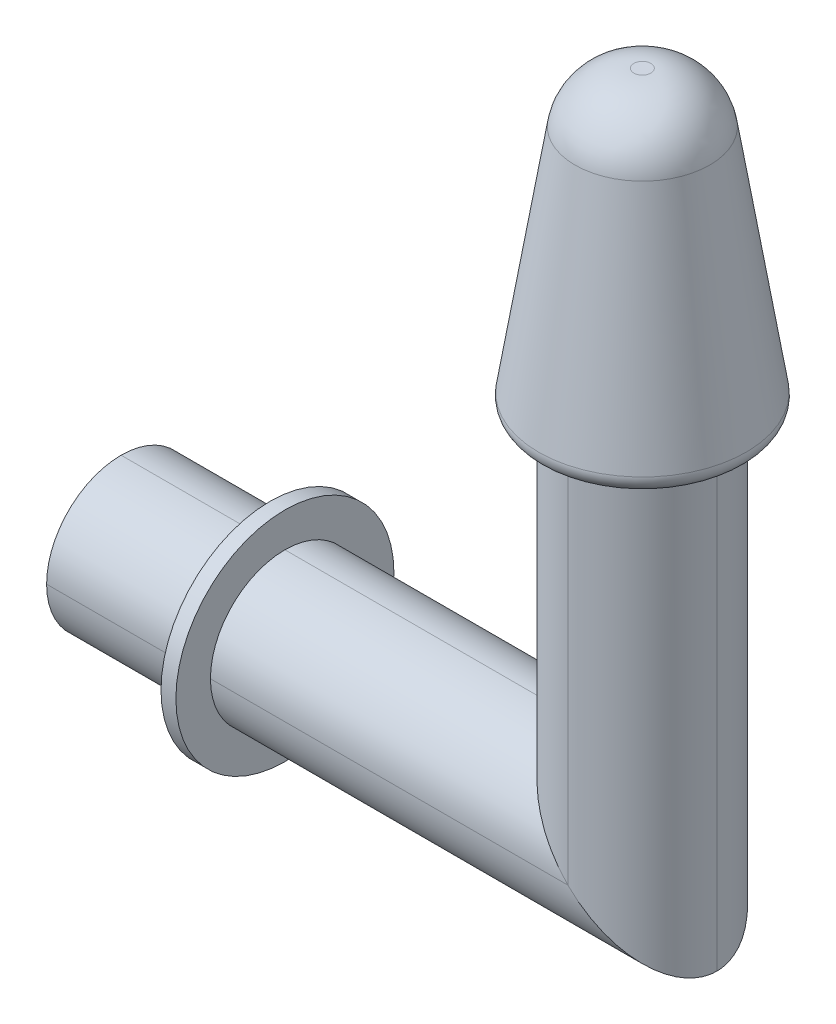
ISO-10303-21;
HEADER;
FILE_DESCRIPTION(('STEP AP214'),'2;1');
FILE_NAME('part.step','',(''),(''),'','','');
FILE_SCHEMA(('AUTOMOTIVE_DESIGN { 1 0 10303 214 1 1 1 1 }'));
ENDSEC;
DATA;
#1=APPLICATION_CONTEXT('core data for automotive mechanical design processes');
#2=APPLICATION_PROTOCOL_DEFINITION('international standard','automotive_design',2000,#1);
#3=PRODUCT_CONTEXT('',#1,'mechanical');
#4=PRODUCT('Part','Part','',(#3));
#5=PRODUCT_RELATED_PRODUCT_CATEGORY('part','',(#4));
#6=PRODUCT_DEFINITION_FORMATION('','',#4);
#7=PRODUCT_DEFINITION_CONTEXT('part definition',#1,'design');
#8=PRODUCT_DEFINITION('design','',#6,#7);
#9=PRODUCT_DEFINITION_SHAPE('','',#8);
#10=(LENGTH_UNIT() NAMED_UNIT(*) SI_UNIT(.MILLI.,.METRE.));
#11=(NAMED_UNIT(*) PLANE_ANGLE_UNIT() SI_UNIT($,.RADIAN.));
#12=(NAMED_UNIT(*) SI_UNIT($,.STERADIAN.) SOLID_ANGLE_UNIT());
#13=UNCERTAINTY_MEASURE_WITH_UNIT(LENGTH_MEASURE(1.E-05),#10,'distance_accuracy_value','');
#14=(GEOMETRIC_REPRESENTATION_CONTEXT(3) GLOBAL_UNCERTAINTY_ASSIGNED_CONTEXT((#13)) GLOBAL_UNIT_ASSIGNED_CONTEXT((#10,
#11,#12)) REPRESENTATION_CONTEXT('',''));
#15=CARTESIAN_POINT('',(0.,0.,0.));
#16=DIRECTION('',(0.,0.,1.));
#17=DIRECTION('',(1.,0.,0.));
#18=AXIS2_PLACEMENT_3D('',#15,#16,#17);
#19=CARTESIAN_POINT('',(-15.,-2.5,2.5));
#20=DIRECTION('',(-1.,0.,0.));
#21=DIRECTION('',(0.,0.,1.));
#22=AXIS2_PLACEMENT_3D('',#19,#20,#21);
#23=CYLINDRICAL_SURFACE('',#22,2.5);
#24=DIRECTION('',(1.,0.,0.));
#25=VECTOR('',#24,1.);
#26=CARTESIAN_POINT('',(5.,-5.,2.5));
#27=LINE('',#26,#25);
#28=CARTESIAN_POINT('',(-9.5,-5.,2.5));
#29=VERTEX_POINT('',#28);
#30=CARTESIAN_POINT('',(5.,-5.,2.5));
#31=VERTEX_POINT('',#30);
#32=EDGE_CURVE('E296',#29,#31,#27,.T.);
#33=ORIENTED_EDGE('',*,*,#32,.F.);
#34=CARTESIAN_POINT('',(-9.5,-2.5,2.5));
#35=DIRECTION('',(-1.,0.,0.));
#36=DIRECTION('',(0.,0.,1.));
#37=AXIS2_PLACEMENT_3D('',#34,#35,#36);
#38=CIRCLE('',#37,2.5);
#39=CARTESIAN_POINT('',(-9.5,-2.5,0.));
#40=VERTEX_POINT('',#39);
#41=EDGE_CURVE('E232',#29,#40,#38,.F.);
#42=ORIENTED_EDGE('',*,*,#41,.T.);
#43=DIRECTION('',(1.,0.,0.));
#44=VECTOR('',#43,1.);
#45=CARTESIAN_POINT('',(-15.,-2.5,0.));
#46=LINE('',#45,#44);
#47=CARTESIAN_POINT('',(2.5,-2.5,0.));
#48=VERTEX_POINT('',#47);
#49=EDGE_CURVE('E255',#48,#40,#46,.F.);
#50=ORIENTED_EDGE('',*,*,#49,.F.);
#51=CARTESIAN_POINT('',(2.5,-2.5,2.5));
#52=DIRECTION('',(-0.707106781186548,-0.707106781186547,0.));
#53=DIRECTION('',(-0.707106781186547,0.707106781186548,0.));
#54=AXIS2_PLACEMENT_3D('',#51,#52,#53);
#55=ELLIPSE('',#54,3.53553390593274,2.5);
#56=EDGE_CURVE('E299',#31,#48,#55,.F.);
#57=ORIENTED_EDGE('',*,*,#56,.F.);
#58=EDGE_LOOP('',(#33,#42,#50,#57));
#59=FACE_BOUND('',#58,.T.);
#60=ADVANCED_FACE('F36',(#59),#23,.T.);
#61=CARTESIAN_POINT('',(0.,-2.5,2.5));
#62=DIRECTION('',(1.,0.,0.));
#63=DIRECTION('',(0.,1.,0.));
#64=AXIS2_PLACEMENT_3D('',#61,#62,#63);
#65=CYLINDRICAL_SURFACE('',#64,2.5);
#66=ORIENTED_EDGE('',*,*,#49,.T.);
#67=CARTESIAN_POINT('',(-9.5,-2.5,2.5));
#68=DIRECTION('',(-1.,0.,0.));
#69=DIRECTION('',(0.,0.,1.));
#70=AXIS2_PLACEMENT_3D('',#67,#68,#69);
#71=CIRCLE('',#70,2.5);
#72=CARTESIAN_POINT('',(-9.5,0.,2.5));
#73=VERTEX_POINT('',#72);
#74=EDGE_CURVE('E493',#40,#73,#71,.F.);
#75=ORIENTED_EDGE('',*,*,#74,.T.);
#76=DIRECTION('',(-1.,0.,0.));
#77=VECTOR('',#76,1.);
#78=CARTESIAN_POINT('',(-15.,0.,2.5));
#79=LINE('',#78,#77);
#80=CARTESIAN_POINT('',(0.,0.,2.5));
#81=VERTEX_POINT('',#80);
#82=EDGE_CURVE('E279',#81,#73,#79,.T.);
#83=ORIENTED_EDGE('',*,*,#82,.F.);
#84=CARTESIAN_POINT('',(2.5,-2.5,2.5));
#85=DIRECTION('',(0.707106781186547,0.707106781186547,0.));
#86=DIRECTION('',(-0.707106781186547,0.707106781186547,0.));
#87=AXIS2_PLACEMENT_3D('',#84,#85,#86);
#88=ELLIPSE('',#87,3.53553390593274,2.5);
#89=EDGE_CURVE('E293',#48,#81,#88,.T.);
#90=ORIENTED_EDGE('',*,*,#89,.F.);
#91=EDGE_LOOP('',(#66,#75,#83,#90));
#92=FACE_BOUND('',#91,.T.);
#93=ADVANCED_FACE('F352',(#92),#65,.T.);
#94=CARTESIAN_POINT('',(0.,-2.5,2.5));
#95=DIRECTION('',(1.,0.,0.));
#96=DIRECTION('',(0.,0.,-1.));
#97=AXIS2_PLACEMENT_3D('',#94,#95,#96);
#98=CYLINDRICAL_SURFACE('',#97,2.5);
#99=DIRECTION('',(1.,0.,0.));
#100=VECTOR('',#99,1.);
#101=CARTESIAN_POINT('',(0.,-2.5,5.));
#102=LINE('',#101,#100);
#103=CARTESIAN_POINT('',(-9.5,-2.5,5.));
#104=VERTEX_POINT('',#103);
#105=CARTESIAN_POINT('',(2.5,-2.5,5.));
#106=VERTEX_POINT('',#105);
#107=EDGE_CURVE('E254',#104,#106,#102,.T.);
#108=ORIENTED_EDGE('',*,*,#107,.F.);
#109=CARTESIAN_POINT('',(-9.5,-2.5,2.5));
#110=DIRECTION('',(-1.,0.,0.));
#111=DIRECTION('',(0.,0.,1.));
#112=AXIS2_PLACEMENT_3D('',#109,#110,#111);
#113=CIRCLE('',#112,2.5);
#114=EDGE_CURVE('E491',#104,#29,#113,.F.);
#115=ORIENTED_EDGE('',*,*,#114,.T.);
#116=ORIENTED_EDGE('',*,*,#32,.T.);
#117=CARTESIAN_POINT('',(2.5,-2.5,2.5));
#118=DIRECTION('',(0.707106781186548,0.707106781186547,0.));
#119=DIRECTION('',(-0.707106781186547,0.707106781186548,0.));
#120=AXIS2_PLACEMENT_3D('',#117,#118,#119);
#121=ELLIPSE('',#120,3.53553390593274,2.5);
#122=EDGE_CURVE('E284',#106,#31,#121,.T.);
#123=ORIENTED_EDGE('',*,*,#122,.F.);
#124=EDGE_LOOP('',(#108,#115,#116,#123));
#125=FACE_BOUND('',#124,.T.);
#126=ADVANCED_FACE('F359',(#125),#98,.T.);
#127=CARTESIAN_POINT('',(0.,-2.5,2.5));
#128=DIRECTION('',(-1.,0.,0.));
#129=DIRECTION('',(0.,-1.,0.));
#130=AXIS2_PLACEMENT_3D('',#127,#128,#129);
#131=CYLINDRICAL_SURFACE('',#130,2.5);
#132=ORIENTED_EDGE('',*,*,#82,.T.);
#133=CARTESIAN_POINT('',(-9.5,-2.5,2.5));
#134=DIRECTION('',(-1.,0.,0.));
#135=DIRECTION('',(0.,0.,1.));
#136=AXIS2_PLACEMENT_3D('',#133,#134,#135);
#137=CIRCLE('',#136,2.5);
#138=EDGE_CURVE('E488',#73,#104,#137,.F.);
#139=ORIENTED_EDGE('',*,*,#138,.T.);
#140=ORIENTED_EDGE('',*,*,#107,.T.);
#141=CARTESIAN_POINT('',(2.5,-2.5,2.5));
#142=DIRECTION('',(-0.707106781186547,-0.707106781186547,0.));
#143=DIRECTION('',(-0.707106781186547,0.707106781186547,0.));
#144=AXIS2_PLACEMENT_3D('',#141,#142,#143);
#145=ELLIPSE('',#144,3.53553390593274,2.5);
#146=EDGE_CURVE('E307',#81,#106,#145,.F.);
#147=ORIENTED_EDGE('',*,*,#146,.F.);
#148=EDGE_LOOP('',(#132,#139,#140,#147));
#149=FACE_BOUND('',#148,.T.);
#150=ADVANCED_FACE('F384',(#149),#131,.T.);
#151=CARTESIAN_POINT('',(2.5,-5.,2.5));
#152=DIRECTION('',(0.,-1.,0.));
#153=DIRECTION('',(1.,0.,0.));
#154=AXIS2_PLACEMENT_3D('',#151,#152,#153);
#155=CYLINDRICAL_SURFACE('',#154,2.5);
#156=DIRECTION('',(0.,1.,0.));
#157=VECTOR('',#156,1.);
#158=CARTESIAN_POINT('',(5.,10.,2.5));
#159=LINE('',#158,#157);
#160=CARTESIAN_POINT('',(5.,10.,2.5));
#161=VERTEX_POINT('',#160);
#162=EDGE_CURVE('E287',#31,#161,#159,.T.);
#163=ORIENTED_EDGE('',*,*,#162,.F.);
#164=ORIENTED_EDGE('',*,*,#56,.T.);
#165=DIRECTION('',(0.,1.,0.));
#166=VECTOR('',#165,1.);
#167=CARTESIAN_POINT('',(2.5,-5.,0.));
#168=LINE('',#167,#166);
#169=CARTESIAN_POINT('',(2.5,10.,0.));
#170=VERTEX_POINT('',#169);
#171=EDGE_CURVE('E290',#170,#48,#168,.F.);
#172=ORIENTED_EDGE('',*,*,#171,.F.);
#173=CARTESIAN_POINT('',(2.5,10.,2.5));
#174=DIRECTION('',(0.,-1.,0.));
#175=DIRECTION('',(0.,0.,-1.));
#176=AXIS2_PLACEMENT_3D('',#173,#174,#175);
#177=CIRCLE('',#176,2.5);
#178=EDGE_CURVE('E261',#161,#170,#177,.F.);
#179=ORIENTED_EDGE('',*,*,#178,.F.);
#180=EDGE_LOOP('',(#163,#164,#172,#179));
#181=FACE_BOUND('',#180,.T.);
#182=ADVANCED_FACE('F381',(#181),#155,.T.);
#183=CARTESIAN_POINT('',(2.5,10.,2.5));
#184=DIRECTION('',(0.,1.,0.));
#185=DIRECTION('',(-1.,0.,0.));
#186=AXIS2_PLACEMENT_3D('',#183,#184,#185);
#187=CYLINDRICAL_SURFACE('',#186,2.5);
#188=ORIENTED_EDGE('',*,*,#171,.T.);
#189=ORIENTED_EDGE('',*,*,#89,.T.);
#190=DIRECTION('',(0.,-1.,0.));
#191=VECTOR('',#190,1.);
#192=CARTESIAN_POINT('',(0.,0.,2.5));
#193=LINE('',#192,#191);
#194=CARTESIAN_POINT('',(0.,10.,2.5));
#195=VERTEX_POINT('',#194);
#196=EDGE_CURVE('E236',#195,#81,#193,.T.);
#197=ORIENTED_EDGE('',*,*,#196,.F.);
#198=CARTESIAN_POINT('',(2.5,10.,2.5));
#199=DIRECTION('',(0.,-1.,0.));
#200=DIRECTION('',(0.,0.,-1.));
#201=AXIS2_PLACEMENT_3D('',#198,#199,#200);
#202=CIRCLE('',#201,2.5);
#203=EDGE_CURVE('E258',#170,#195,#202,.F.);
#204=ORIENTED_EDGE('',*,*,#203,.F.);
#205=EDGE_LOOP('',(#188,#189,#197,#204));
#206=FACE_BOUND('',#205,.T.);
#207=ADVANCED_FACE('F383',(#206),#187,.T.);
#208=CARTESIAN_POINT('',(2.5,0.,2.5));
#209=DIRECTION('',(0.,1.,0.));
#210=DIRECTION('',(-1.,0.,0.));
#211=AXIS2_PLACEMENT_3D('',#208,#209,#210);
#212=CYLINDRICAL_SURFACE('',#211,2.5);
#213=ORIENTED_EDGE('',*,*,#162,.T.);
#214=CARTESIAN_POINT('',(2.5,10.,2.5));
#215=DIRECTION('',(0.,-1.,0.));
#216=DIRECTION('',(0.,0.,-1.));
#217=AXIS2_PLACEMENT_3D('',#214,#215,#216);
#218=CIRCLE('',#217,2.5);
#219=CARTESIAN_POINT('',(2.5,10.,5.));
#220=VERTEX_POINT('',#219);
#221=EDGE_CURVE('E264',#220,#161,#218,.F.);
#222=ORIENTED_EDGE('',*,*,#221,.F.);
#223=DIRECTION('',(0.,1.,0.));
#224=VECTOR('',#223,1.);
#225=CARTESIAN_POINT('',(2.5,0.,5.));
#226=LINE('',#225,#224);
#227=EDGE_CURVE('E252',#106,#220,#226,.T.);
#228=ORIENTED_EDGE('',*,*,#227,.F.);
#229=ORIENTED_EDGE('',*,*,#122,.T.);
#230=EDGE_LOOP('',(#213,#222,#228,#229));
#231=FACE_BOUND('',#230,.T.);
#232=ADVANCED_FACE('F389',(#231),#212,.T.);
#233=CARTESIAN_POINT('',(2.5,0.,2.5));
#234=DIRECTION('',(0.,-1.,0.));
#235=DIRECTION('',(1.,0.,0.));
#236=AXIS2_PLACEMENT_3D('',#233,#234,#235);
#237=CYLINDRICAL_SURFACE('',#236,2.5);
#238=CARTESIAN_POINT('',(2.5,10.,2.5));
#239=DIRECTION('',(0.,-1.,0.));
#240=DIRECTION('',(0.,0.,-1.));
#241=AXIS2_PLACEMENT_3D('',#238,#239,#240);
#242=CIRCLE('',#241,2.5);
#243=EDGE_CURVE('E267',#195,#220,#242,.F.);
#244=ORIENTED_EDGE('',*,*,#243,.F.);
#245=ORIENTED_EDGE('',*,*,#196,.T.);
#246=ORIENTED_EDGE('',*,*,#146,.T.);
#247=ORIENTED_EDGE('',*,*,#227,.T.);
#248=EDGE_LOOP('',(#244,#245,#246,#247));
#249=FACE_BOUND('',#248,.T.);
#250=ADVANCED_FACE('F347',(#249),#237,.T.);
#251=CARTESIAN_POINT('',(2.5,10.,2.5));
#252=DIRECTION('',(0.,1.,0.));
#253=DIRECTION('',(0.,0.,1.));
#254=AXIS2_PLACEMENT_3D('',#251,#252,#253);
#255=PLANE('',#254);
#256=CARTESIAN_POINT('',(2.5,10.,2.5));
#257=DIRECTION('',(0.,1.,0.));
#258=DIRECTION('',(0.,0.,1.));
#259=AXIS2_PLACEMENT_3D('',#256,#257,#258);
#260=CIRCLE('',#259,2.99033715568735);
#261=CARTESIAN_POINT('',(2.5,10.,5.49033715568735));
#262=VERTEX_POINT('',#261);
#263=EDGE_CURVE('E185',#262,#262,#260,.F.);
#264=ORIENTED_EDGE('',*,*,#263,.T.);
#265=EDGE_LOOP('',(#264));
#266=FACE_BOUND('',#265,.T.);
#267=ORIENTED_EDGE('',*,*,#178,.T.);
#268=ORIENTED_EDGE('',*,*,#203,.T.);
#269=ORIENTED_EDGE('',*,*,#243,.T.);
#270=ORIENTED_EDGE('',*,*,#221,.T.);
#271=EDGE_LOOP('',(#267,#268,#269,#270));
#272=FACE_BOUND('',#271,.T.);
#273=ADVANCED_FACE('F322',(#266,#272),#255,.F.);
#274=CARTESIAN_POINT('',(2.5,20.,2.5));
#275=DIRECTION('',(0.,1.,0.));
#276=DIRECTION('',(0.,0.,1.));
#277=AXIS2_PLACEMENT_3D('',#274,#275,#276);
#278=PLANE('',#277);
#279=CARTESIAN_POINT('',(2.5,20.,2.5));
#280=DIRECTION('',(0.,1.,0.));
#281=DIRECTION('',(0.,0.,1.));
#282=AXIS2_PLACEMENT_3D('',#279,#280,#281);
#283=CIRCLE('',#282,0.283756164571326);
#284=CARTESIAN_POINT('',(2.5,20.,2.78375616457133));
#285=VERTEX_POINT('',#284);
#286=EDGE_CURVE('E310',#285,#285,#283,.T.);
#287=ORIENTED_EDGE('',*,*,#286,.T.);
#288=EDGE_LOOP('',(#287));
#289=FACE_BOUND('',#288,.T.);
#290=ADVANCED_FACE('F334',(#289),#278,.T.);
#291=CARTESIAN_POINT('',(2.5,10.,2.5));
#292=DIRECTION('',(0.,-1.,0.));
#293=DIRECTION('',(0.,0.,1.));
#294=AXIS2_PLACEMENT_3D('',#291,#292,#293);
#295=CONICAL_SURFACE('',#294,3.57576193874362,0.15707963267949);
#296=CARTESIAN_POINT('',(2.5,10.5782172325201,2.5));
#297=DIRECTION('',(0.,1.,0.));
#298=DIRECTION('',(0.,0.,1.));
#299=AXIS2_PLACEMENT_3D('',#296,#297,#298);
#300=CIRCLE('',#299,3.48418132598492);
#301=CARTESIAN_POINT('',(2.5,10.5782172325201,5.98418132598492));
#302=VERTEX_POINT('',#301);
#303=EDGE_CURVE('E316',#302,#302,#300,.T.);
#304=ORIENTED_EDGE('',*,*,#303,.T.);
#305=EDGE_LOOP('',(#304));
#306=FACE_BOUND('',#305,.T.);
#307=CARTESIAN_POINT('',(2.5,18.3128689300805,2.5));
#308=DIRECTION('',(0.,-1.,0.));
#309=DIRECTION('',(0.,0.,-1.));
#310=AXIS2_PLACEMENT_3D('',#307,#308,#309);
#311=CIRCLE('',#310,2.2591328457616);
#312=CARTESIAN_POINT('',(2.5,18.3128689300805,0.240867154238399));
#313=VERTEX_POINT('',#312);
#314=EDGE_CURVE('E313',#313,#313,#311,.T.);
#315=ORIENTED_EDGE('',*,*,#314,.T.);
#316=EDGE_LOOP('',(#315));
#317=FACE_BOUND('',#316,.T.);
#318=ADVANCED_FACE('F331',(#306,#317),#295,.T.);
#319=CARTESIAN_POINT('',(2.5,18.,2.5));
#320=DIRECTION('',(0.,1.,0.));
#321=DIRECTION('',(0.,0.,1.));
#322=AXIS2_PLACEMENT_3D('',#319,#320,#321);
#323=DEGENERATE_TOROIDAL_SURFACE('',#322,0.283756164571326,2.,.T.);
#324=ORIENTED_EDGE('',*,*,#314,.F.);
#325=EDGE_LOOP('',(#324));
#326=FACE_BOUND('',#325,.T.);
#327=ORIENTED_EDGE('',*,*,#286,.F.);
#328=EDGE_LOOP('',(#327));
#329=FACE_BOUND('',#328,.T.);
#330=ADVANCED_FACE('F328',(#326,#329),#323,.T.);
#331=CARTESIAN_POINT('',(2.5,10.5,2.5));
#332=DIRECTION('',(0.,1.,0.));
#333=DIRECTION('',(0.,0.,1.));
#334=AXIS2_PLACEMENT_3D('',#331,#332,#333);
#335=TOROIDAL_SURFACE('',#334,2.99033715568735,0.5);
#336=ORIENTED_EDGE('',*,*,#263,.F.);
#337=EDGE_LOOP('',(#336));
#338=FACE_BOUND('',#337,.T.);
#339=ORIENTED_EDGE('',*,*,#303,.F.);
#340=EDGE_LOOP('',(#339));
#341=FACE_BOUND('',#340,.T.);
#342=ADVANCED_FACE('F38',(#338,#341),#335,.T.);
#343=CARTESIAN_POINT('',(-9.5,-2.5,2.5));
#344=DIRECTION('',(-1.,0.,0.));
#345=DIRECTION('',(0.,0.,1.));
#346=AXIS2_PLACEMENT_3D('',#343,#344,#345);
#347=CYLINDRICAL_SURFACE('',#346,3.66000857921071);
#348=CARTESIAN_POINT('',(-9.5,-2.5,2.5));
#349=DIRECTION('',(-1.,0.,0.));
#350=DIRECTION('',(0.,0.,1.));
#351=AXIS2_PLACEMENT_3D('',#348,#349,#350);
#352=CIRCLE('',#351,3.66000857921071);
#353=CARTESIAN_POINT('',(-9.5,-2.5,6.16000857921071));
#354=VERTEX_POINT('',#353);
#355=EDGE_CURVE('E464',#354,#354,#352,.T.);
#356=ORIENTED_EDGE('',*,*,#355,.T.);
#357=EDGE_LOOP('',(#356));
#358=FACE_BOUND('',#357,.T.);
#359=CARTESIAN_POINT('',(-10.,-2.5,2.5));
#360=DIRECTION('',(-1.,0.,0.));
#361=DIRECTION('',(0.,0.,1.));
#362=AXIS2_PLACEMENT_3D('',#359,#360,#361);
#363=CIRCLE('',#362,3.66000857921071);
#364=CARTESIAN_POINT('',(-10.,-2.5,6.16000857921071));
#365=VERTEX_POINT('',#364);
#366=EDGE_CURVE('E465',#365,#365,#363,.T.);
#367=ORIENTED_EDGE('',*,*,#366,.F.);
#368=EDGE_LOOP('',(#367));
#369=FACE_BOUND('',#368,.T.);
#370=ADVANCED_FACE('F327',(#358,#369),#347,.T.);
#371=CARTESIAN_POINT('',(-9.5,-2.5,2.5));
#372=DIRECTION('',(-1.,0.,0.));
#373=DIRECTION('',(0.,0.,1.));
#374=AXIS2_PLACEMENT_3D('',#371,#372,#373);
#375=PLANE('',#374);
#376=ORIENTED_EDGE('',*,*,#41,.F.);
#377=ORIENTED_EDGE('',*,*,#114,.F.);
#378=ORIENTED_EDGE('',*,*,#138,.F.);
#379=ORIENTED_EDGE('',*,*,#74,.F.);
#380=EDGE_LOOP('',(#376,#377,#378,#379));
#381=FACE_BOUND('',#380,.T.);
#382=ORIENTED_EDGE('',*,*,#355,.F.);
#383=EDGE_LOOP('',(#382));
#384=FACE_BOUND('',#383,.T.);
#385=ADVANCED_FACE('F445',(#381,#384),#375,.F.);
#386=CARTESIAN_POINT('',(-10.,-2.5,2.5));
#387=DIRECTION('',(-1.,0.,0.));
#388=DIRECTION('',(0.,0.,1.));
#389=AXIS2_PLACEMENT_3D('',#386,#387,#388);
#390=PLANE('',#389);
#391=CARTESIAN_POINT('',(-10.,-2.5,2.5));
#392=DIRECTION('',(-1.,0.,0.));
#393=DIRECTION('',(0.,0.,1.));
#394=AXIS2_PLACEMENT_3D('',#391,#392,#393);
#395=CIRCLE('',#394,2.5);
#396=CARTESIAN_POINT('',(-10.,-2.5,5.));
#397=VERTEX_POINT('',#396);
#398=CARTESIAN_POINT('',(-10.,-5.,2.5));
#399=VERTEX_POINT('',#398);
#400=EDGE_CURVE('E475',#397,#399,#395,.F.);
#401=ORIENTED_EDGE('',*,*,#400,.T.);
#402=CARTESIAN_POINT('',(-10.,-2.5,2.5));
#403=DIRECTION('',(-1.,0.,0.));
#404=DIRECTION('',(0.,0.,1.));
#405=AXIS2_PLACEMENT_3D('',#402,#403,#404);
#406=CIRCLE('',#405,2.5);
#407=CARTESIAN_POINT('',(-10.,-2.5,0.));
#408=VERTEX_POINT('',#407);
#409=EDGE_CURVE('E59',#399,#408,#406,.F.);
#410=ORIENTED_EDGE('',*,*,#409,.T.);
#411=CARTESIAN_POINT('',(-10.,-2.5,2.5));
#412=DIRECTION('',(-1.,0.,0.));
#413=DIRECTION('',(0.,0.,1.));
#414=AXIS2_PLACEMENT_3D('',#411,#412,#413);
#415=CIRCLE('',#414,2.5);
#416=CARTESIAN_POINT('',(-10.,0.,2.5));
#417=VERTEX_POINT('',#416);
#418=EDGE_CURVE('E52',#408,#417,#415,.F.);
#419=ORIENTED_EDGE('',*,*,#418,.T.);
#420=CARTESIAN_POINT('',(-10.,-2.5,2.5));
#421=DIRECTION('',(-1.,0.,0.));
#422=DIRECTION('',(0.,0.,1.));
#423=AXIS2_PLACEMENT_3D('',#420,#421,#422);
#424=CIRCLE('',#423,2.5);
#425=EDGE_CURVE('E472',#417,#397,#424,.F.);
#426=ORIENTED_EDGE('',*,*,#425,.T.);
#427=EDGE_LOOP('',(#401,#410,#419,#426));
#428=FACE_BOUND('',#427,.T.);
#429=ORIENTED_EDGE('',*,*,#366,.T.);
#430=EDGE_LOOP('',(#429));
#431=FACE_BOUND('',#430,.T.);
#432=ADVANCED_FACE('F433',(#428,#431),#390,.T.);
#433=ORIENTED_EDGE('',*,*,#425,.F.);
#434=CARTESIAN_POINT('',(-15.,0.,2.5));
#435=VERTEX_POINT('',#434);
#436=EDGE_CURVE('E278',#417,#435,#79,.T.);
#437=ORIENTED_EDGE('',*,*,#436,.T.);
#438=CARTESIAN_POINT('',(-15.,-2.5,2.5));
#439=DIRECTION('',(1.,0.,0.));
#440=DIRECTION('',(0.,0.,-1.));
#441=AXIS2_PLACEMENT_3D('',#438,#439,#440);
#442=CIRCLE('',#441,2.5);
#443=CARTESIAN_POINT('',(-15.,-2.5,5.));
#444=VERTEX_POINT('',#443);
#445=EDGE_CURVE('E282',#444,#435,#442,.F.);
#446=ORIENTED_EDGE('',*,*,#445,.F.);
#447=EDGE_CURVE('E256',#444,#397,#102,.T.);
#448=ORIENTED_EDGE('',*,*,#447,.T.);
#449=EDGE_LOOP('',(#433,#437,#446,#448));
#450=FACE_BOUND('',#449,.T.);
#451=ADVANCED_FACE('F377',(#450),#131,.T.);
#452=ORIENTED_EDGE('',*,*,#400,.F.);
#453=ORIENTED_EDGE('',*,*,#447,.F.);
#454=CARTESIAN_POINT('',(-15.,-2.5,2.5));
#455=DIRECTION('',(1.,0.,0.));
#456=DIRECTION('',(0.,0.,-1.));
#457=AXIS2_PLACEMENT_3D('',#454,#455,#456);
#458=CIRCLE('',#457,2.5);
#459=CARTESIAN_POINT('',(-15.,-5.,2.5));
#460=VERTEX_POINT('',#459);
#461=EDGE_CURVE('E275',#460,#444,#458,.F.);
#462=ORIENTED_EDGE('',*,*,#461,.F.);
#463=EDGE_CURVE('E297',#460,#399,#27,.T.);
#464=ORIENTED_EDGE('',*,*,#463,.T.);
#465=EDGE_LOOP('',(#452,#453,#462,#464));
#466=FACE_BOUND('',#465,.T.);
#467=ADVANCED_FACE('F373',(#466),#98,.T.);
#468=ORIENTED_EDGE('',*,*,#418,.F.);
#469=CARTESIAN_POINT('',(-15.,-2.5,0.));
#470=VERTEX_POINT('',#469);
#471=EDGE_CURVE('E302',#408,#470,#46,.F.);
#472=ORIENTED_EDGE('',*,*,#471,.T.);
#473=CARTESIAN_POINT('',(-15.,-2.5,2.5));
#474=DIRECTION('',(1.,0.,0.));
#475=DIRECTION('',(0.,0.,-1.));
#476=AXIS2_PLACEMENT_3D('',#473,#474,#475);
#477=CIRCLE('',#476,2.5);
#478=EDGE_CURVE('E272',#435,#470,#477,.F.);
#479=ORIENTED_EDGE('',*,*,#478,.F.);
#480=ORIENTED_EDGE('',*,*,#436,.F.);
#481=EDGE_LOOP('',(#468,#472,#479,#480));
#482=FACE_BOUND('',#481,.T.);
#483=ADVANCED_FACE('F362',(#482),#65,.T.);
#484=ORIENTED_EDGE('',*,*,#409,.F.);
#485=ORIENTED_EDGE('',*,*,#463,.F.);
#486=CARTESIAN_POINT('',(-15.,-2.5,2.5));
#487=DIRECTION('',(1.,0.,0.));
#488=DIRECTION('',(0.,0.,-1.));
#489=AXIS2_PLACEMENT_3D('',#486,#487,#488);
#490=CIRCLE('',#489,2.5);
#491=EDGE_CURVE('E270',#470,#460,#490,.F.);
#492=ORIENTED_EDGE('',*,*,#491,.F.);
#493=ORIENTED_EDGE('',*,*,#471,.F.);
#494=EDGE_LOOP('',(#484,#485,#492,#493));
#495=FACE_BOUND('',#494,.T.);
#496=ADVANCED_FACE('F355',(#495),#23,.T.);
#497=CARTESIAN_POINT('',(-15.,0.,5.));
#498=DIRECTION('',(1.,0.,0.));
#499=DIRECTION('',(0.,0.,-1.));
#500=AXIS2_PLACEMENT_3D('',#497,#498,#499);
#501=PLANE('',#500);
#502=CARTESIAN_POINT('',(-15.,-2.5,2.5));
#503=DIRECTION('',(1.,0.,0.));
#504=DIRECTION('',(0.,0.,-1.));
#505=AXIS2_PLACEMENT_3D('',#502,#503,#504);
#506=CIRCLE('',#505,2.3);
#507=CARTESIAN_POINT('',(-15.,-4.8,2.5));
#508=VERTEX_POINT('',#507);
#509=CARTESIAN_POINT('',(-15.,-2.5,4.8));
#510=VERTEX_POINT('',#509);
#511=EDGE_CURVE('E200',#508,#510,#506,.F.);
#512=ORIENTED_EDGE('',*,*,#511,.F.);
#513=CARTESIAN_POINT('',(-15.,-2.5,2.5));
#514=DIRECTION('',(1.,0.,0.));
#515=DIRECTION('',(0.,0.,-1.));
#516=AXIS2_PLACEMENT_3D('',#513,#514,#515);
#517=CIRCLE('',#516,2.3);
#518=CARTESIAN_POINT('',(-15.,-2.5,0.2));
#519=VERTEX_POINT('',#518);
#520=EDGE_CURVE('E237',#519,#508,#517,.F.);
#521=ORIENTED_EDGE('',*,*,#520,.F.);
#522=CARTESIAN_POINT('',(-15.,-2.5,2.5));
#523=DIRECTION('',(1.,0.,0.));
#524=DIRECTION('',(0.,0.,-1.));
#525=AXIS2_PLACEMENT_3D('',#522,#523,#524);
#526=CIRCLE('',#525,2.3);
#527=CARTESIAN_POINT('',(-15.,-0.200000000000002,2.5));
#528=VERTEX_POINT('',#527);
#529=EDGE_CURVE('E203',#528,#519,#526,.F.);
#530=ORIENTED_EDGE('',*,*,#529,.F.);
#531=CARTESIAN_POINT('',(-15.,-2.5,2.5));
#532=DIRECTION('',(1.,0.,0.));
#533=DIRECTION('',(0.,0.,-1.));
#534=AXIS2_PLACEMENT_3D('',#531,#532,#533);
#535=CIRCLE('',#534,2.3);
#536=EDGE_CURVE('E197',#510,#528,#535,.F.);
#537=ORIENTED_EDGE('',*,*,#536,.F.);
#538=EDGE_LOOP('',(#512,#521,#530,#537));
#539=FACE_BOUND('',#538,.T.);
#540=ORIENTED_EDGE('',*,*,#461,.T.);
#541=ORIENTED_EDGE('',*,*,#445,.T.);
#542=ORIENTED_EDGE('',*,*,#478,.T.);
#543=ORIENTED_EDGE('',*,*,#491,.T.);
#544=EDGE_LOOP('',(#540,#541,#542,#543));
#545=FACE_BOUND('',#544,.T.);
#546=ADVANCED_FACE('F366',(#539,#545),#501,.F.);
#547=CARTESIAN_POINT('',(0.,-2.5,2.5));
#548=DIRECTION('',(-1.,0.,0.));
#549=DIRECTION('',(0.,-1.,0.));
#550=AXIS2_PLACEMENT_3D('',#547,#548,#549);
#551=CYLINDRICAL_SURFACE('',#550,2.3);
#552=DIRECTION('',(-1.,0.,0.));
#553=VECTOR('',#552,1.);
#554=CARTESIAN_POINT('',(0.,-0.2,2.5));
#555=LINE('',#554,#553);
#556=CARTESIAN_POINT('',(-10.,-0.200000000000001,2.5));
#557=VERTEX_POINT('',#556);
#558=EDGE_CURVE('E190',#557,#528,#555,.T.);
#559=ORIENTED_EDGE('',*,*,#558,.F.);
#560=CARTESIAN_POINT('',(-10.,-2.5,2.5));
#561=DIRECTION('',(-1.,0.,0.));
#562=DIRECTION('',(0.,0.,1.));
#563=AXIS2_PLACEMENT_3D('',#560,#561,#562);
#564=CIRCLE('',#563,2.3);
#565=CARTESIAN_POINT('',(-10.,-2.5,4.8));
#566=VERTEX_POINT('',#565);
#567=EDGE_CURVE('E45',#557,#566,#564,.F.);
#568=ORIENTED_EDGE('',*,*,#567,.T.);
#569=DIRECTION('',(-1.,0.,0.));
#570=VECTOR('',#569,1.);
#571=CARTESIAN_POINT('',(0.,-2.5,4.8));
#572=LINE('',#571,#570);
#573=EDGE_CURVE('E223',#510,#566,#572,.F.);
#574=ORIENTED_EDGE('',*,*,#573,.F.);
#575=ORIENTED_EDGE('',*,*,#536,.T.);
#576=EDGE_LOOP('',(#559,#568,#574,#575));
#577=FACE_BOUND('',#576,.T.);
#578=ADVANCED_FACE('F195',(#577),#551,.F.);
#579=CARTESIAN_POINT('',(0.,-2.5,2.5));
#580=DIRECTION('',(1.,0.,0.));
#581=DIRECTION('',(0.,0.,-1.));
#582=AXIS2_PLACEMENT_3D('',#579,#580,#581);
#583=CYLINDRICAL_SURFACE('',#582,2.3);
#584=ORIENTED_EDGE('',*,*,#573,.T.);
#585=CARTESIAN_POINT('',(-10.,-2.5,2.5));
#586=DIRECTION('',(-1.,0.,0.));
#587=DIRECTION('',(0.,0.,1.));
#588=AXIS2_PLACEMENT_3D('',#585,#586,#587);
#589=CIRCLE('',#588,2.3);
#590=CARTESIAN_POINT('',(-10.,-4.8,2.5));
#591=VERTEX_POINT('',#590);
#592=EDGE_CURVE('E180',#566,#591,#589,.F.);
#593=ORIENTED_EDGE('',*,*,#592,.T.);
#594=DIRECTION('',(1.,0.,0.));
#595=VECTOR('',#594,1.);
#596=CARTESIAN_POINT('',(0.,-4.8,2.5));
#597=LINE('',#596,#595);
#598=EDGE_CURVE('E497',#508,#591,#597,.T.);
#599=ORIENTED_EDGE('',*,*,#598,.F.);
#600=ORIENTED_EDGE('',*,*,#511,.T.);
#601=EDGE_LOOP('',(#584,#593,#599,#600));
#602=FACE_BOUND('',#601,.T.);
#603=ADVANCED_FACE('F399',(#602),#583,.F.);
#604=CARTESIAN_POINT('',(0.,-2.5,2.5));
#605=DIRECTION('',(1.,0.,0.));
#606=DIRECTION('',(0.,1.,0.));
#607=AXIS2_PLACEMENT_3D('',#604,#605,#606);
#608=CYLINDRICAL_SURFACE('',#607,2.3);
#609=DIRECTION('',(1.,0.,0.));
#610=VECTOR('',#609,1.);
#611=CARTESIAN_POINT('',(0.,-2.5,0.2));
#612=LINE('',#611,#610);
#613=CARTESIAN_POINT('',(-10.,-2.5,0.2));
#614=VERTEX_POINT('',#613);
#615=EDGE_CURVE('E192',#614,#519,#612,.F.);
#616=ORIENTED_EDGE('',*,*,#615,.F.);
#617=CARTESIAN_POINT('',(-10.,-2.5,2.5));
#618=DIRECTION('',(-1.,0.,0.));
#619=DIRECTION('',(0.,0.,1.));
#620=AXIS2_PLACEMENT_3D('',#617,#618,#619);
#621=CIRCLE('',#620,2.3);
#622=EDGE_CURVE('E177',#614,#557,#621,.F.);
#623=ORIENTED_EDGE('',*,*,#622,.T.);
#624=ORIENTED_EDGE('',*,*,#558,.T.);
#625=ORIENTED_EDGE('',*,*,#529,.T.);
#626=EDGE_LOOP('',(#616,#623,#624,#625));
#627=FACE_BOUND('',#626,.T.);
#628=ADVANCED_FACE('F188',(#627),#608,.F.);
#629=CARTESIAN_POINT('',(-15.,-2.5,2.5));
#630=DIRECTION('',(-1.,0.,0.));
#631=DIRECTION('',(0.,0.,1.));
#632=AXIS2_PLACEMENT_3D('',#629,#630,#631);
#633=CYLINDRICAL_SURFACE('',#632,2.3);
#634=ORIENTED_EDGE('',*,*,#598,.T.);
#635=CARTESIAN_POINT('',(-10.,-2.5,2.5));
#636=DIRECTION('',(-1.,0.,0.));
#637=DIRECTION('',(0.,0.,1.));
#638=AXIS2_PLACEMENT_3D('',#635,#636,#637);
#639=CIRCLE('',#638,2.3);
#640=EDGE_CURVE('E193',#591,#614,#639,.F.);
#641=ORIENTED_EDGE('',*,*,#640,.T.);
#642=ORIENTED_EDGE('',*,*,#615,.T.);
#643=ORIENTED_EDGE('',*,*,#520,.T.);
#644=EDGE_LOOP('',(#634,#641,#642,#643));
#645=FACE_BOUND('',#644,.T.);
#646=ADVANCED_FACE('F424',(#645),#633,.F.);
#647=ORIENTED_EDGE('',*,*,#640,.F.);
#648=ORIENTED_EDGE('',*,*,#592,.F.);
#649=ORIENTED_EDGE('',*,*,#567,.F.);
#650=ORIENTED_EDGE('',*,*,#622,.F.);
#651=EDGE_LOOP('',(#647,#648,#649,#650));
#652=FACE_BOUND('',#651,.T.);
#653=ADVANCED_FACE('F176',(#652),#390,.T.);
#654=CLOSED_SHELL('',(#60,#93,#126,#150,#182,#207,#232,#250,#273,#290,#318,#330,#342,#370,#385,
#432,#451,#467,#483,#496,#546,#578,#603,#628,#646,#653));
#655=CARTESIAN_POINT('',(-9.5,-2.5,2.5));
#656=DIRECTION('',(-1.,0.,0.));
#657=DIRECTION('',(0.,0.,1.));
#658=AXIS2_PLACEMENT_3D('',#655,#656,#657);
#659=CIRCLE('',#658,2.3);
#660=CARTESIAN_POINT('',(-9.5,-2.5,4.8));
#661=VERTEX_POINT('',#660);
#662=CARTESIAN_POINT('',(-9.5,-4.8,2.5));
#663=VERTEX_POINT('',#662);
#664=EDGE_CURVE('E480',#661,#663,#659,.F.);
#665=ORIENTED_EDGE('',*,*,#664,.T.);
#666=CARTESIAN_POINT('',(-9.5,-2.5,2.5));
#667=DIRECTION('',(-1.,0.,0.));
#668=DIRECTION('',(0.,0.,1.));
#669=AXIS2_PLACEMENT_3D('',#666,#667,#668);
#670=CIRCLE('',#669,2.3);
#671=CARTESIAN_POINT('',(-9.5,-2.5,0.2));
#672=VERTEX_POINT('',#671);
#673=EDGE_CURVE('E485',#663,#672,#670,.F.);
#674=ORIENTED_EDGE('',*,*,#673,.T.);
#675=CARTESIAN_POINT('',(-9.5,-2.5,2.5));
#676=DIRECTION('',(-1.,0.,0.));
#677=DIRECTION('',(0.,0.,1.));
#678=AXIS2_PLACEMENT_3D('',#675,#676,#677);
#679=CIRCLE('',#678,2.3);
#680=CARTESIAN_POINT('',(-9.5,-0.200000000000001,2.5));
#681=VERTEX_POINT('',#680);
#682=EDGE_CURVE('E482',#672,#681,#679,.F.);
#683=ORIENTED_EDGE('',*,*,#682,.T.);
#684=CARTESIAN_POINT('',(-9.5,-2.5,2.5));
#685=DIRECTION('',(-1.,0.,0.));
#686=DIRECTION('',(0.,0.,1.));
#687=AXIS2_PLACEMENT_3D('',#684,#685,#686);
#688=CIRCLE('',#687,2.3);
#689=EDGE_CURVE('E11',#681,#661,#688,.F.);
#690=ORIENTED_EDGE('',*,*,#689,.T.);
#691=EDGE_LOOP('',(#665,#674,#683,#690));
#692=FACE_BOUND('',#691,.T.);
#693=ADVANCED_FACE('F441',(#692),#375,.F.);
#694=CARTESIAN_POINT('',(2.5,10.,2.5));
#695=DIRECTION('',(0.,-1.,0.));
#696=DIRECTION('',(0.,0.,-1.));
#697=AXIS2_PLACEMENT_3D('',#694,#695,#696);
#698=CIRCLE('',#697,2.3);
#699=CARTESIAN_POINT('',(2.5,10.,0.2));
#700=VERTEX_POINT('',#699);
#701=CARTESIAN_POINT('',(0.200000000000001,10.,2.5));
#702=VERTEX_POINT('',#701);
#703=EDGE_CURVE('E225',#700,#702,#698,.F.);
#704=ORIENTED_EDGE('',*,*,#703,.F.);
#705=CARTESIAN_POINT('',(2.5,10.,2.5));
#706=DIRECTION('',(0.,-1.,0.));
#707=DIRECTION('',(0.,0.,-1.));
#708=AXIS2_PLACEMENT_3D('',#705,#706,#707);
#709=CIRCLE('',#708,2.3);
#710=CARTESIAN_POINT('',(4.8,10.,2.5));
#711=VERTEX_POINT('',#710);
#712=EDGE_CURVE('E242',#711,#700,#709,.F.);
#713=ORIENTED_EDGE('',*,*,#712,.F.);
#714=CARTESIAN_POINT('',(2.5,10.,2.5));
#715=DIRECTION('',(0.,-1.,0.));
#716=DIRECTION('',(0.,0.,-1.));
#717=AXIS2_PLACEMENT_3D('',#714,#715,#716);
#718=CIRCLE('',#717,2.3);
#719=CARTESIAN_POINT('',(2.5,10.,4.8));
#720=VERTEX_POINT('',#719);
#721=EDGE_CURVE('E245',#720,#711,#718,.F.);
#722=ORIENTED_EDGE('',*,*,#721,.F.);
#723=CARTESIAN_POINT('',(2.5,10.,2.5));
#724=DIRECTION('',(0.,-1.,0.));
#725=DIRECTION('',(0.,0.,-1.));
#726=AXIS2_PLACEMENT_3D('',#723,#724,#725);
#727=CIRCLE('',#726,2.3);
#728=EDGE_CURVE('E238',#702,#720,#727,.F.);
#729=ORIENTED_EDGE('',*,*,#728,.F.);
#730=EDGE_LOOP('',(#704,#713,#722,#729));
#731=FACE_BOUND('',#730,.T.);
#732=ADVANCED_FACE('F349',(#731),#255,.F.);
#733=CARTESIAN_POINT('',(2.5,-5.,2.5));
#734=DIRECTION('',(0.,-1.,0.));
#735=DIRECTION('',(1.,0.,0.));
#736=AXIS2_PLACEMENT_3D('',#733,#734,#735);
#737=CYLINDRICAL_SURFACE('',#736,2.3);
#738=DIRECTION('',(0.,1.,0.));
#739=VECTOR('',#738,1.);
#740=CARTESIAN_POINT('',(4.8,0.,2.5));
#741=LINE('',#740,#739);
#742=CARTESIAN_POINT('',(4.8,-4.8,2.5));
#743=VERTEX_POINT('',#742);
#744=EDGE_CURVE('E214',#743,#711,#741,.T.);
#745=ORIENTED_EDGE('',*,*,#744,.T.);
#746=ORIENTED_EDGE('',*,*,#712,.T.);
#747=DIRECTION('',(0.,1.,0.));
#748=VECTOR('',#747,1.);
#749=CARTESIAN_POINT('',(2.5,10.,0.2));
#750=LINE('',#749,#748);
#751=CARTESIAN_POINT('',(2.5,-2.5,0.2));
#752=VERTEX_POINT('',#751);
#753=EDGE_CURVE('E213',#700,#752,#750,.F.);
#754=ORIENTED_EDGE('',*,*,#753,.T.);
#755=CARTESIAN_POINT('',(2.5,-2.5,2.5));
#756=DIRECTION('',(-0.707106781186548,-0.707106781186547,0.));
#757=DIRECTION('',(0.707106781186547,-0.707106781186548,0.));
#758=AXIS2_PLACEMENT_3D('',#755,#756,#757);
#759=ELLIPSE('',#758,3.25269119345812,2.3);
#760=EDGE_CURVE('E207',#743,#752,#759,.F.);
#761=ORIENTED_EDGE('',*,*,#760,.F.);
#762=EDGE_LOOP('',(#745,#746,#754,#761));
#763=FACE_BOUND('',#762,.T.);
#764=ADVANCED_FACE('F413',(#763),#737,.F.);
#765=CARTESIAN_POINT('',(2.5,10.,2.5));
#766=DIRECTION('',(0.,1.,0.));
#767=DIRECTION('',(-1.,0.,0.));
#768=AXIS2_PLACEMENT_3D('',#765,#766,#767);
#769=CYLINDRICAL_SURFACE('',#768,2.3);
#770=ORIENTED_EDGE('',*,*,#753,.F.);
#771=ORIENTED_EDGE('',*,*,#703,.T.);
#772=DIRECTION('',(0.,-1.,0.));
#773=VECTOR('',#772,1.);
#774=CARTESIAN_POINT('',(0.2,0.,2.5));
#775=LINE('',#774,#773);
#776=CARTESIAN_POINT('',(0.2,-0.2,2.5));
#777=VERTEX_POINT('',#776);
#778=EDGE_CURVE('E222',#702,#777,#775,.T.);
#779=ORIENTED_EDGE('',*,*,#778,.T.);
#780=CARTESIAN_POINT('',(2.5,-2.5,2.5));
#781=DIRECTION('',(0.707106781186547,0.707106781186547,0.));
#782=DIRECTION('',(0.707106781186547,-0.707106781186547,0.));
#783=AXIS2_PLACEMENT_3D('',#780,#781,#782);
#784=ELLIPSE('',#783,3.25269119345812,2.3);
#785=EDGE_CURVE('E209',#752,#777,#784,.T.);
#786=ORIENTED_EDGE('',*,*,#785,.F.);
#787=EDGE_LOOP('',(#770,#771,#779,#786));
#788=FACE_BOUND('',#787,.T.);
#789=ADVANCED_FACE('F409',(#788),#769,.F.);
#790=CARTESIAN_POINT('',(2.5,0.,2.5));
#791=DIRECTION('',(0.,1.,0.));
#792=DIRECTION('',(-1.,0.,0.));
#793=AXIS2_PLACEMENT_3D('',#790,#791,#792);
#794=CYLINDRICAL_SURFACE('',#793,2.3);
#795=ORIENTED_EDGE('',*,*,#744,.F.);
#796=CARTESIAN_POINT('',(2.5,-2.5,2.5));
#797=DIRECTION('',(0.707106781186548,0.707106781186547,0.));
#798=DIRECTION('',(-0.707106781186547,0.707106781186548,0.));
#799=AXIS2_PLACEMENT_3D('',#796,#797,#798);
#800=ELLIPSE('',#799,3.25269119345812,2.3);
#801=CARTESIAN_POINT('',(2.5,-2.5,4.8));
#802=VERTEX_POINT('',#801);
#803=EDGE_CURVE('E217',#802,#743,#800,.T.);
#804=ORIENTED_EDGE('',*,*,#803,.F.);
#805=DIRECTION('',(0.,-1.,0.));
#806=VECTOR('',#805,1.);
#807=CARTESIAN_POINT('',(2.5,0.,4.8));
#808=LINE('',#807,#806);
#809=EDGE_CURVE('E227',#802,#720,#808,.F.);
#810=ORIENTED_EDGE('',*,*,#809,.T.);
#811=ORIENTED_EDGE('',*,*,#721,.T.);
#812=EDGE_LOOP('',(#795,#804,#810,#811));
#813=FACE_BOUND('',#812,.T.);
#814=ADVANCED_FACE('F404',(#813),#794,.F.);
#815=CARTESIAN_POINT('',(2.5,0.,2.5));
#816=DIRECTION('',(0.,-1.,0.));
#817=DIRECTION('',(1.,0.,0.));
#818=AXIS2_PLACEMENT_3D('',#815,#816,#817);
#819=CYLINDRICAL_SURFACE('',#818,2.3);
#820=ORIENTED_EDGE('',*,*,#728,.T.);
#821=ORIENTED_EDGE('',*,*,#809,.F.);
#822=CARTESIAN_POINT('',(2.5,-2.5,2.5));
#823=DIRECTION('',(-0.707106781186547,-0.707106781186547,0.));
#824=DIRECTION('',(-0.707106781186547,0.707106781186547,0.));
#825=AXIS2_PLACEMENT_3D('',#822,#823,#824);
#826=ELLIPSE('',#825,3.25269119345812,2.3);
#827=EDGE_CURVE('E233',#777,#802,#826,.F.);
#828=ORIENTED_EDGE('',*,*,#827,.F.);
#829=ORIENTED_EDGE('',*,*,#778,.F.);
#830=EDGE_LOOP('',(#820,#821,#828,#829));
#831=FACE_BOUND('',#830,.T.);
#832=ADVANCED_FACE('F401',(#831),#819,.F.);
#833=ORIENTED_EDGE('',*,*,#689,.F.);
#834=EDGE_CURVE('E199',#777,#681,#555,.T.);
#835=ORIENTED_EDGE('',*,*,#834,.F.);
#836=ORIENTED_EDGE('',*,*,#827,.T.);
#837=EDGE_CURVE('E226',#661,#802,#572,.F.);
#838=ORIENTED_EDGE('',*,*,#837,.F.);
#839=EDGE_LOOP('',(#833,#835,#836,#838));
#840=FACE_BOUND('',#839,.T.);
#841=ADVANCED_FACE('F400',(#840),#551,.F.);
#842=ORIENTED_EDGE('',*,*,#664,.F.);
#843=ORIENTED_EDGE('',*,*,#837,.T.);
#844=ORIENTED_EDGE('',*,*,#803,.T.);
#845=EDGE_CURVE('E212',#663,#743,#597,.T.);
#846=ORIENTED_EDGE('',*,*,#845,.F.);
#847=EDGE_LOOP('',(#842,#843,#844,#846));
#848=FACE_BOUND('',#847,.T.);
#849=ADVANCED_FACE('F418',(#848),#583,.F.);
#850=ORIENTED_EDGE('',*,*,#682,.F.);
#851=EDGE_CURVE('E230',#752,#672,#612,.F.);
#852=ORIENTED_EDGE('',*,*,#851,.F.);
#853=ORIENTED_EDGE('',*,*,#785,.T.);
#854=ORIENTED_EDGE('',*,*,#834,.T.);
#855=EDGE_LOOP('',(#850,#852,#853,#854));
#856=FACE_BOUND('',#855,.T.);
#857=ADVANCED_FACE('F425',(#856),#608,.F.);
#858=ORIENTED_EDGE('',*,*,#673,.F.);
#859=ORIENTED_EDGE('',*,*,#845,.T.);
#860=ORIENTED_EDGE('',*,*,#760,.T.);
#861=ORIENTED_EDGE('',*,*,#851,.T.);
#862=EDGE_LOOP('',(#858,#859,#860,#861));
#863=FACE_BOUND('',#862,.T.);
#864=ADVANCED_FACE('F428',(#863),#633,.F.);
#865=CLOSED_SHELL('',(#693,#732,#764,#789,#814,#832,#841,#849,#857,#864));
#866=ORIENTED_CLOSED_SHELL('',*,#865,.T.);
#867=BREP_WITH_VOIDS('B2',#654,(#866));
#868=ADVANCED_BREP_SHAPE_REPRESENTATION('',(#18,#867),#14);
#869=SHAPE_DEFINITION_REPRESENTATION(#9,#868);
ENDSEC;
END-ISO-10303-21;
